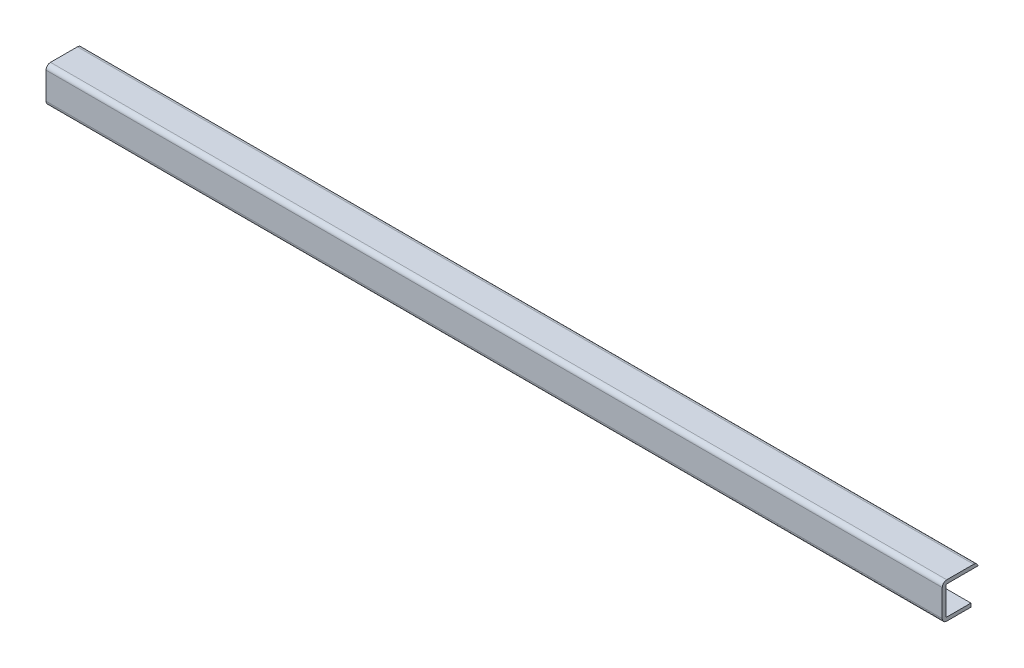
ISO-10303-21;
HEADER;
FILE_DESCRIPTION(('STEP AP214'),'2;1');
FILE_NAME('part.step','',(''),(''),'','','');
FILE_SCHEMA(('AUTOMOTIVE_DESIGN { 1 0 10303 214 1 1 1 1 }'));
ENDSEC;
DATA;
#1=APPLICATION_CONTEXT('core data for automotive mechanical design processes');
#2=APPLICATION_PROTOCOL_DEFINITION('international standard','automotive_design',2000,#1);
#3=PRODUCT_CONTEXT('',#1,'mechanical');
#4=PRODUCT('Part','Part','',(#3));
#5=PRODUCT_RELATED_PRODUCT_CATEGORY('part','',(#4));
#6=PRODUCT_DEFINITION_FORMATION('','',#4);
#7=PRODUCT_DEFINITION_CONTEXT('part definition',#1,'design');
#8=PRODUCT_DEFINITION('design','',#6,#7);
#9=PRODUCT_DEFINITION_SHAPE('','',#8);
#10=(LENGTH_UNIT() NAMED_UNIT(*) SI_UNIT(.MILLI.,.METRE.));
#11=(NAMED_UNIT(*) PLANE_ANGLE_UNIT() SI_UNIT($,.RADIAN.));
#12=(NAMED_UNIT(*) SI_UNIT($,.STERADIAN.) SOLID_ANGLE_UNIT());
#13=UNCERTAINTY_MEASURE_WITH_UNIT(LENGTH_MEASURE(1.E-05),#10,'distance_accuracy_value','');
#14=(GEOMETRIC_REPRESENTATION_CONTEXT(3) GLOBAL_UNCERTAINTY_ASSIGNED_CONTEXT((#13)) GLOBAL_UNIT_ASSIGNED_CONTEXT((#10,
#11,#12)) REPRESENTATION_CONTEXT('',''));
#15=CARTESIAN_POINT('',(0.,0.,0.));
#16=DIRECTION('',(0.,0.,1.));
#17=DIRECTION('',(1.,0.,0.));
#18=AXIS2_PLACEMENT_3D('',#15,#16,#17);
#19=CARTESIAN_POINT('',(1000.,1.,-1.));
#20=DIRECTION('',(-1.,0.,0.));
#21=DIRECTION('',(0.,0.,1.));
#22=AXIS2_PLACEMENT_3D('',#19,#20,#21);
#23=PLANE('',#22);
#24=DIRECTION('',(0.,0.,-1.));
#25=VECTOR('',#24,1.);
#26=CARTESIAN_POINT('',(1000.,-4.,-1.));
#27=LINE('',#26,#25);
#28=CARTESIAN_POINT('',(1000.,-4.,-1.00000000000001));
#29=VERTEX_POINT('',#28);
#30=CARTESIAN_POINT('',(1000.,-4.,-28.));
#31=VERTEX_POINT('',#30);
#32=EDGE_CURVE('E185',#29,#31,#27,.T.);
#33=ORIENTED_EDGE('',*,*,#32,.T.);
#34=DIRECTION('',(0.,-1.,0.));
#35=VECTOR('',#34,1.);
#36=CARTESIAN_POINT('',(1000.,32.,-28.));
#37=LINE('',#36,#35);
#38=CARTESIAN_POINT('',(1000.,0.,-28.));
#39=VERTEX_POINT('',#38);
#40=EDGE_CURVE('E172',#39,#31,#37,.T.);
#41=ORIENTED_EDGE('',*,*,#40,.F.);
#42=DIRECTION('',(0.,0.,-1.));
#43=VECTOR('',#42,1.);
#44=CARTESIAN_POINT('',(1000.,0.,-1.00000000000001));
#45=LINE('',#44,#43);
#46=CARTESIAN_POINT('',(1000.,0.,-1.00000000000001));
#47=VERTEX_POINT('',#46);
#48=EDGE_CURVE('E183',#47,#39,#45,.T.);
#49=ORIENTED_EDGE('',*,*,#48,.F.);
#50=CARTESIAN_POINT('',(1000.,1.,-1.));
#51=DIRECTION('',(1.,0.,0.));
#52=DIRECTION('',(0.,0.,1.));
#53=AXIS2_PLACEMENT_3D('',#50,#51,#52);
#54=CIRCLE('',#53,1.);
#55=CARTESIAN_POINT('',(1000.,1.00000000000001,0.));
#56=VERTEX_POINT('',#55);
#57=EDGE_CURVE('E192',#56,#47,#54,.T.);
#58=ORIENTED_EDGE('',*,*,#57,.F.);
#59=DIRECTION('',(0.,-1.,0.));
#60=VECTOR('',#59,1.);
#61=CARTESIAN_POINT('',(1000.,1.00000000000001,0.));
#62=LINE('',#61,#60);
#63=CARTESIAN_POINT('',(1000.,31.,0.));
#64=VERTEX_POINT('',#63);
#65=EDGE_CURVE('E201',#64,#56,#62,.T.);
#66=ORIENTED_EDGE('',*,*,#65,.F.);
#67=CARTESIAN_POINT('',(1000.,31.,-1.));
#68=DIRECTION('',(1.,0.,0.));
#69=DIRECTION('',(0.,0.,-1.));
#70=AXIS2_PLACEMENT_3D('',#67,#68,#69);
#71=CIRCLE('',#70,1.);
#72=CARTESIAN_POINT('',(1000.,32.,-1.));
#73=VERTEX_POINT('',#72);
#74=EDGE_CURVE('E194',#73,#64,#71,.T.);
#75=ORIENTED_EDGE('',*,*,#74,.F.);
#76=DIRECTION('',(0.,0.,1.));
#77=VECTOR('',#76,1.);
#78=CARTESIAN_POINT('',(1000.,32.,-1.));
#79=LINE('',#78,#77);
#80=CARTESIAN_POINT('',(1000.,32.,-35.8989794855664));
#81=VERTEX_POINT('',#80);
#82=EDGE_CURVE('E191',#81,#73,#79,.T.);
#83=ORIENTED_EDGE('',*,*,#82,.F.);
#84=CARTESIAN_POINT('',(1000.,31.,-31.));
#85=DIRECTION('',(-1.,0.,0.));
#86=DIRECTION('',(0.,0.,1.));
#87=AXIS2_PLACEMENT_3D('',#84,#85,#86);
#88=CIRCLE('',#87,5.);
#89=CARTESIAN_POINT('',(1000.,36.,-31.));
#90=VERTEX_POINT('',#89);
#91=EDGE_CURVE('E229',#81,#90,#88,.F.);
#92=ORIENTED_EDGE('',*,*,#91,.T.);
#93=DIRECTION('',(0.,0.,1.));
#94=VECTOR('',#93,1.);
#95=CARTESIAN_POINT('',(1000.,36.,-1.));
#96=LINE('',#95,#94);
#97=CARTESIAN_POINT('',(1000.,36.,-1.));
#98=VERTEX_POINT('',#97);
#99=EDGE_CURVE('E231',#90,#98,#96,.T.);
#100=ORIENTED_EDGE('',*,*,#99,.T.);
#101=CARTESIAN_POINT('',(1000.,31.,-1.));
#102=DIRECTION('',(-1.,0.,0.));
#103=DIRECTION('',(0.,0.,1.));
#104=AXIS2_PLACEMENT_3D('',#101,#102,#103);
#105=CIRCLE('',#104,5.);
#106=CARTESIAN_POINT('',(1000.,31.,4.));
#107=VERTEX_POINT('',#106);
#108=EDGE_CURVE('E233',#98,#107,#105,.F.);
#109=ORIENTED_EDGE('',*,*,#108,.T.);
#110=DIRECTION('',(0.,-1.,0.));
#111=VECTOR('',#110,1.);
#112=CARTESIAN_POINT('',(1000.,1.,4.));
#113=LINE('',#112,#111);
#114=CARTESIAN_POINT('',(1000.,1.00000000000001,4.));
#115=VERTEX_POINT('',#114);
#116=EDGE_CURVE('E235',#107,#115,#113,.T.);
#117=ORIENTED_EDGE('',*,*,#116,.T.);
#118=CARTESIAN_POINT('',(1000.,1.,-1.));
#119=DIRECTION('',(-1.,0.,0.));
#120=DIRECTION('',(0.,0.,1.));
#121=AXIS2_PLACEMENT_3D('',#118,#119,#120);
#122=CIRCLE('',#121,5.);
#123=EDGE_CURVE('E225',#115,#29,#122,.F.);
#124=ORIENTED_EDGE('',*,*,#123,.T.);
#125=EDGE_LOOP('',(#33,#41,#49,#58,#66,#75,#83,#92,#100,#109,#117,#124));
#126=FACE_BOUND('',#125,.T.);
#127=ADVANCED_FACE('F83',(#126),#23,.F.);
#128=CARTESIAN_POINT('',(0.,1.,-1.));
#129=DIRECTION('',(-1.,0.,0.));
#130=DIRECTION('',(0.,0.,1.));
#131=AXIS2_PLACEMENT_3D('',#128,#129,#130);
#132=PLANE('',#131);
#133=DIRECTION('',(0.,-1.,0.));
#134=VECTOR('',#133,1.);
#135=CARTESIAN_POINT('',(0.,32.,-28.));
#136=LINE('',#135,#134);
#137=CARTESIAN_POINT('',(0.,0.,-28.));
#138=VERTEX_POINT('',#137);
#139=CARTESIAN_POINT('',(0.,-4.,-28.));
#140=VERTEX_POINT('',#139);
#141=EDGE_CURVE('E98',#138,#140,#136,.T.);
#142=ORIENTED_EDGE('',*,*,#141,.T.);
#143=DIRECTION('',(0.,0.,-1.));
#144=VECTOR('',#143,1.);
#145=CARTESIAN_POINT('',(0.,-4.,-1.));
#146=LINE('',#145,#144);
#147=CARTESIAN_POINT('',(0.,-4.,-1.00000000000001));
#148=VERTEX_POINT('',#147);
#149=EDGE_CURVE('E240',#148,#140,#146,.T.);
#150=ORIENTED_EDGE('',*,*,#149,.F.);
#151=CARTESIAN_POINT('',(0.,1.,-1.));
#152=DIRECTION('',(-1.,0.,0.));
#153=DIRECTION('',(0.,0.,1.));
#154=AXIS2_PLACEMENT_3D('',#151,#152,#153);
#155=CIRCLE('',#154,5.);
#156=CARTESIAN_POINT('',(0.,1.00000000000001,4.));
#157=VERTEX_POINT('',#156);
#158=EDGE_CURVE('E224',#157,#148,#155,.F.);
#159=ORIENTED_EDGE('',*,*,#158,.F.);
#160=DIRECTION('',(0.,-1.,0.));
#161=VECTOR('',#160,1.);
#162=CARTESIAN_POINT('',(0.,1.,4.));
#163=LINE('',#162,#161);
#164=CARTESIAN_POINT('',(0.,31.,4.));
#165=VERTEX_POINT('',#164);
#166=EDGE_CURVE('E227',#165,#157,#163,.T.);
#167=ORIENTED_EDGE('',*,*,#166,.F.);
#168=CARTESIAN_POINT('',(0.,31.,-1.));
#169=DIRECTION('',(-1.,0.,0.));
#170=DIRECTION('',(0.,0.,1.));
#171=AXIS2_PLACEMENT_3D('',#168,#169,#170);
#172=CIRCLE('',#171,5.);
#173=CARTESIAN_POINT('',(0.,36.,-1.));
#174=VERTEX_POINT('',#173);
#175=EDGE_CURVE('E247',#174,#165,#172,.F.);
#176=ORIENTED_EDGE('',*,*,#175,.F.);
#177=DIRECTION('',(0.,0.,1.));
#178=VECTOR('',#177,1.);
#179=CARTESIAN_POINT('',(0.,36.,-1.));
#180=LINE('',#179,#178);
#181=CARTESIAN_POINT('',(0.,36.,-31.));
#182=VERTEX_POINT('',#181);
#183=EDGE_CURVE('E245',#182,#174,#180,.T.);
#184=ORIENTED_EDGE('',*,*,#183,.F.);
#185=CARTESIAN_POINT('',(0.,31.,-31.));
#186=DIRECTION('',(-1.,0.,0.));
#187=DIRECTION('',(0.,0.,1.));
#188=AXIS2_PLACEMENT_3D('',#185,#186,#187);
#189=CIRCLE('',#188,5.);
#190=CARTESIAN_POINT('',(0.,32.,-35.8989794855664));
#191=VERTEX_POINT('',#190);
#192=EDGE_CURVE('E243',#191,#182,#189,.F.);
#193=ORIENTED_EDGE('',*,*,#192,.F.);
#194=DIRECTION('',(0.,0.,1.));
#195=VECTOR('',#194,1.);
#196=CARTESIAN_POINT('',(0.,32.,-1.));
#197=LINE('',#196,#195);
#198=CARTESIAN_POINT('',(0.,32.,-1.));
#199=VERTEX_POINT('',#198);
#200=EDGE_CURVE('E210',#191,#199,#197,.T.);
#201=ORIENTED_EDGE('',*,*,#200,.T.);
#202=CARTESIAN_POINT('',(0.,31.,-1.));
#203=DIRECTION('',(1.,0.,0.));
#204=DIRECTION('',(0.,0.,-1.));
#205=AXIS2_PLACEMENT_3D('',#202,#203,#204);
#206=CIRCLE('',#205,1.);
#207=CARTESIAN_POINT('',(0.,31.,0.));
#208=VERTEX_POINT('',#207);
#209=EDGE_CURVE('E212',#199,#208,#206,.T.);
#210=ORIENTED_EDGE('',*,*,#209,.T.);
#211=DIRECTION('',(0.,-1.,0.));
#212=VECTOR('',#211,1.);
#213=CARTESIAN_POINT('',(0.,1.00000000000001,0.));
#214=LINE('',#213,#212);
#215=CARTESIAN_POINT('',(0.,1.00000000000001,0.));
#216=VERTEX_POINT('',#215);
#217=EDGE_CURVE('E196',#208,#216,#214,.T.);
#218=ORIENTED_EDGE('',*,*,#217,.T.);
#219=CARTESIAN_POINT('',(0.,1.,-1.));
#220=DIRECTION('',(1.,0.,0.));
#221=DIRECTION('',(0.,0.,1.));
#222=AXIS2_PLACEMENT_3D('',#219,#220,#221);
#223=CIRCLE('',#222,1.);
#224=CARTESIAN_POINT('',(0.,0.,-1.00000000000001));
#225=VERTEX_POINT('',#224);
#226=EDGE_CURVE('E204',#216,#225,#223,.T.);
#227=ORIENTED_EDGE('',*,*,#226,.T.);
#228=DIRECTION('',(0.,0.,-1.));
#229=VECTOR('',#228,1.);
#230=CARTESIAN_POINT('',(0.,0.,-1.00000000000001));
#231=LINE('',#230,#229);
#232=EDGE_CURVE('E207',#225,#138,#231,.T.);
#233=ORIENTED_EDGE('',*,*,#232,.T.);
#234=EDGE_LOOP('',(#142,#150,#159,#167,#176,#184,#193,#201,#210,#218,#227,#233));
#235=FACE_BOUND('',#234,.T.);
#236=ADVANCED_FACE('F269',(#235),#132,.T.);
#237=CARTESIAN_POINT('',(1000.,1.,-1.));
#238=DIRECTION('',(-1.,0.,0.));
#239=DIRECTION('',(0.,0.,1.));
#240=AXIS2_PLACEMENT_3D('',#237,#238,#239);
#241=CYLINDRICAL_SURFACE('',#240,5.);
#242=ORIENTED_EDGE('',*,*,#158,.T.);
#243=DIRECTION('',(-1.,0.,0.));
#244=VECTOR('',#243,1.);
#245=CARTESIAN_POINT('',(1000.,-4.,-1.00000000000001));
#246=LINE('',#245,#244);
#247=EDGE_CURVE('E12',#29,#148,#246,.T.);
#248=ORIENTED_EDGE('',*,*,#247,.F.);
#249=ORIENTED_EDGE('',*,*,#123,.F.);
#250=DIRECTION('',(-1.,0.,0.));
#251=VECTOR('',#250,1.);
#252=CARTESIAN_POINT('',(1000.,1.00000000000001,4.));
#253=LINE('',#252,#251);
#254=EDGE_CURVE('E237',#115,#157,#253,.T.);
#255=ORIENTED_EDGE('',*,*,#254,.T.);
#256=EDGE_LOOP('',(#242,#248,#249,#255));
#257=FACE_BOUND('',#256,.T.);
#258=ADVANCED_FACE('F85',(#257),#241,.T.);
#259=CARTESIAN_POINT('',(1000.,-4.,-1.));
#260=DIRECTION('',(0.,1.,0.));
#261=DIRECTION('',(0.,0.,1.));
#262=AXIS2_PLACEMENT_3D('',#259,#260,#261);
#263=PLANE('',#262);
#264=ORIENTED_EDGE('',*,*,#149,.T.);
#265=DIRECTION('',(1.,0.,0.));
#266=VECTOR('',#265,1.);
#267=CARTESIAN_POINT('',(1000.,-4.,-28.));
#268=LINE('',#267,#266);
#269=EDGE_CURVE('E177',#140,#31,#268,.T.);
#270=ORIENTED_EDGE('',*,*,#269,.T.);
#271=ORIENTED_EDGE('',*,*,#32,.F.);
#272=ORIENTED_EDGE('',*,*,#247,.T.);
#273=EDGE_LOOP('',(#264,#270,#271,#272));
#274=FACE_BOUND('',#273,.T.);
#275=ADVANCED_FACE('F290',(#274),#263,.F.);
#276=CARTESIAN_POINT('',(1000.,31.,-31.));
#277=DIRECTION('',(-1.,0.,0.));
#278=DIRECTION('',(0.,0.,1.));
#279=AXIS2_PLACEMENT_3D('',#276,#277,#278);
#280=CYLINDRICAL_SURFACE('',#279,5.);
#281=ORIENTED_EDGE('',*,*,#91,.F.);
#282=DIRECTION('',(-1.,0.,0.));
#283=VECTOR('',#282,1.);
#284=CARTESIAN_POINT('',(1000.,32.,-35.8989794855664));
#285=LINE('',#284,#283);
#286=EDGE_CURVE('E208',#81,#191,#285,.T.);
#287=ORIENTED_EDGE('',*,*,#286,.T.);
#288=ORIENTED_EDGE('',*,*,#192,.T.);
#289=DIRECTION('',(-1.,0.,0.));
#290=VECTOR('',#289,1.);
#291=CARTESIAN_POINT('',(1000.,36.,-31.));
#292=LINE('',#291,#290);
#293=EDGE_CURVE('E91',#90,#182,#292,.T.);
#294=ORIENTED_EDGE('',*,*,#293,.F.);
#295=EDGE_LOOP('',(#281,#287,#288,#294));
#296=FACE_BOUND('',#295,.T.);
#297=ADVANCED_FACE('F285',(#296),#280,.T.);
#298=CARTESIAN_POINT('',(1000.,36.,-1.));
#299=DIRECTION('',(0.,-1.,0.));
#300=DIRECTION('',(0.,0.,-1.));
#301=AXIS2_PLACEMENT_3D('',#298,#299,#300);
#302=PLANE('',#301);
#303=ORIENTED_EDGE('',*,*,#183,.T.);
#304=DIRECTION('',(-1.,0.,0.));
#305=VECTOR('',#304,1.);
#306=CARTESIAN_POINT('',(1000.,36.,-1.));
#307=LINE('',#306,#305);
#308=EDGE_CURVE('E255',#98,#174,#307,.T.);
#309=ORIENTED_EDGE('',*,*,#308,.F.);
#310=ORIENTED_EDGE('',*,*,#99,.F.);
#311=ORIENTED_EDGE('',*,*,#293,.T.);
#312=EDGE_LOOP('',(#303,#309,#310,#311));
#313=FACE_BOUND('',#312,.T.);
#314=ADVANCED_FACE('F262',(#313),#302,.F.);
#315=CARTESIAN_POINT('',(1000.,31.,-1.));
#316=DIRECTION('',(-1.,0.,0.));
#317=DIRECTION('',(0.,0.,1.));
#318=AXIS2_PLACEMENT_3D('',#315,#316,#317);
#319=CYLINDRICAL_SURFACE('',#318,5.);
#320=ORIENTED_EDGE('',*,*,#175,.T.);
#321=DIRECTION('',(-1.,0.,0.));
#322=VECTOR('',#321,1.);
#323=CARTESIAN_POINT('',(1000.,31.,4.));
#324=LINE('',#323,#322);
#325=EDGE_CURVE('E252',#107,#165,#324,.T.);
#326=ORIENTED_EDGE('',*,*,#325,.F.);
#327=ORIENTED_EDGE('',*,*,#108,.F.);
#328=ORIENTED_EDGE('',*,*,#308,.T.);
#329=EDGE_LOOP('',(#320,#326,#327,#328));
#330=FACE_BOUND('',#329,.T.);
#331=ADVANCED_FACE('F274',(#330),#319,.T.);
#332=CARTESIAN_POINT('',(1000.,1.,4.));
#333=DIRECTION('',(0.,0.,-1.));
#334=DIRECTION('',(-1.,0.,0.));
#335=AXIS2_PLACEMENT_3D('',#332,#333,#334);
#336=PLANE('',#335);
#337=ORIENTED_EDGE('',*,*,#166,.T.);
#338=ORIENTED_EDGE('',*,*,#254,.F.);
#339=ORIENTED_EDGE('',*,*,#116,.F.);
#340=ORIENTED_EDGE('',*,*,#325,.T.);
#341=EDGE_LOOP('',(#337,#338,#339,#340));
#342=FACE_BOUND('',#341,.T.);
#343=ADVANCED_FACE('F278',(#342),#336,.F.);
#344=CARTESIAN_POINT('',(1000.,1.,-1.));
#345=DIRECTION('',(-1.,0.,0.));
#346=DIRECTION('',(0.,0.,1.));
#347=AXIS2_PLACEMENT_3D('',#344,#345,#346);
#348=CYLINDRICAL_SURFACE('',#347,1.);
#349=ORIENTED_EDGE('',*,*,#226,.F.);
#350=DIRECTION('',(-1.,0.,0.));
#351=VECTOR('',#350,1.);
#352=CARTESIAN_POINT('',(1000.,1.00000000000001,0.));
#353=LINE('',#352,#351);
#354=EDGE_CURVE('E203',#56,#216,#353,.T.);
#355=ORIENTED_EDGE('',*,*,#354,.F.);
#356=ORIENTED_EDGE('',*,*,#57,.T.);
#357=DIRECTION('',(-1.,0.,0.));
#358=VECTOR('',#357,1.);
#359=CARTESIAN_POINT('',(1000.,0.,-1.00000000000001));
#360=LINE('',#359,#358);
#361=EDGE_CURVE('E190',#47,#225,#360,.T.);
#362=ORIENTED_EDGE('',*,*,#361,.T.);
#363=EDGE_LOOP('',(#349,#355,#356,#362));
#364=FACE_BOUND('',#363,.T.);
#365=ADVANCED_FACE('F306',(#364),#348,.F.);
#366=CARTESIAN_POINT('',(1000.,0.,-1.00000000000001));
#367=DIRECTION('',(0.,1.,0.));
#368=DIRECTION('',(0.,0.,1.));
#369=AXIS2_PLACEMENT_3D('',#366,#367,#368);
#370=PLANE('',#369);
#371=DIRECTION('',(1.,0.,0.));
#372=VECTOR('',#371,1.);
#373=CARTESIAN_POINT('',(1000.,0.,-28.));
#374=LINE('',#373,#372);
#375=EDGE_CURVE('E169',#138,#39,#374,.T.);
#376=ORIENTED_EDGE('',*,*,#375,.F.);
#377=ORIENTED_EDGE('',*,*,#232,.F.);
#378=ORIENTED_EDGE('',*,*,#361,.F.);
#379=ORIENTED_EDGE('',*,*,#48,.T.);
#380=EDGE_LOOP('',(#376,#377,#378,#379));
#381=FACE_BOUND('',#380,.T.);
#382=ADVANCED_FACE('F188',(#381),#370,.T.);
#383=CARTESIAN_POINT('',(1000.,32.,-1.));
#384=DIRECTION('',(0.,-1.,0.));
#385=DIRECTION('',(0.,0.,-1.));
#386=AXIS2_PLACEMENT_3D('',#383,#384,#385);
#387=PLANE('',#386);
#388=DIRECTION('',(-1.,0.,0.));
#389=VECTOR('',#388,1.);
#390=CARTESIAN_POINT('',(1000.,32.,-1.));
#391=LINE('',#390,#389);
#392=EDGE_CURVE('E220',#73,#199,#391,.T.);
#393=ORIENTED_EDGE('',*,*,#392,.T.);
#394=ORIENTED_EDGE('',*,*,#200,.F.);
#395=ORIENTED_EDGE('',*,*,#286,.F.);
#396=ORIENTED_EDGE('',*,*,#82,.T.);
#397=EDGE_LOOP('',(#393,#394,#395,#396));
#398=FACE_BOUND('',#397,.T.);
#399=ADVANCED_FACE('F325',(#398),#387,.T.);
#400=CARTESIAN_POINT('',(1000.,31.,-1.));
#401=DIRECTION('',(-1.,0.,0.));
#402=DIRECTION('',(0.,0.,1.));
#403=AXIS2_PLACEMENT_3D('',#400,#401,#402);
#404=CYLINDRICAL_SURFACE('',#403,1.);
#405=ORIENTED_EDGE('',*,*,#209,.F.);
#406=ORIENTED_EDGE('',*,*,#392,.F.);
#407=ORIENTED_EDGE('',*,*,#74,.T.);
#408=DIRECTION('',(-1.,0.,0.));
#409=VECTOR('',#408,1.);
#410=CARTESIAN_POINT('',(1000.,31.,0.));
#411=LINE('',#410,#409);
#412=EDGE_CURVE('E106',#64,#208,#411,.T.);
#413=ORIENTED_EDGE('',*,*,#412,.T.);
#414=EDGE_LOOP('',(#405,#406,#407,#413));
#415=FACE_BOUND('',#414,.T.);
#416=ADVANCED_FACE('F334',(#415),#404,.F.);
#417=CARTESIAN_POINT('',(1000.,1.00000000000001,0.));
#418=DIRECTION('',(0.,0.,-1.));
#419=DIRECTION('',(-1.,0.,0.));
#420=AXIS2_PLACEMENT_3D('',#417,#418,#419);
#421=PLANE('',#420);
#422=ORIENTED_EDGE('',*,*,#217,.F.);
#423=ORIENTED_EDGE('',*,*,#412,.F.);
#424=ORIENTED_EDGE('',*,*,#65,.T.);
#425=ORIENTED_EDGE('',*,*,#354,.T.);
#426=EDGE_LOOP('',(#422,#423,#424,#425));
#427=FACE_BOUND('',#426,.T.);
#428=ADVANCED_FACE('F345',(#427),#421,.T.);
#429=CARTESIAN_POINT('',(0.,32.,-28.));
#430=DIRECTION('',(0.,0.,1.));
#431=DIRECTION('',(0.,-1.,0.));
#432=AXIS2_PLACEMENT_3D('',#429,#430,#431);
#433=PLANE('',#432);
#434=ORIENTED_EDGE('',*,*,#141,.F.);
#435=ORIENTED_EDGE('',*,*,#375,.T.);
#436=ORIENTED_EDGE('',*,*,#40,.T.);
#437=ORIENTED_EDGE('',*,*,#269,.F.);
#438=EDGE_LOOP('',(#434,#435,#436,#437));
#439=FACE_BOUND('',#438,.T.);
#440=ADVANCED_FACE('F171',(#439),#433,.F.);
#441=CLOSED_SHELL('',(#127,#236,#258,#275,#297,#314,#331,#343,#365,#382,#399,#416,#428,#440));
#442=MANIFOLD_SOLID_BREP('B2',#441);
#443=ADVANCED_BREP_SHAPE_REPRESENTATION('',(#18,#442),#14);
#444=SHAPE_DEFINITION_REPRESENTATION(#9,#443);
ENDSEC;
END-ISO-10303-21;
